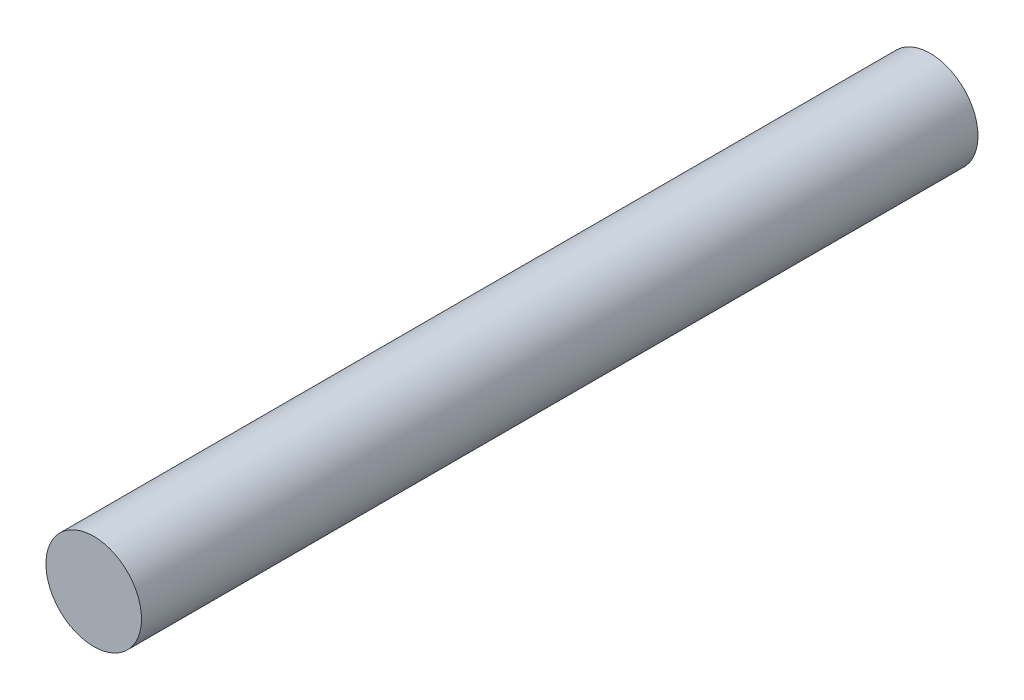
ISO-10303-21;
HEADER;
FILE_DESCRIPTION(('STEP AP214'),'2;1');
FILE_NAME('part.step','',(''),(''),'','','');
FILE_SCHEMA(('AUTOMOTIVE_DESIGN { 1 0 10303 214 1 1 1 1 }'));
ENDSEC;
DATA;
#1=APPLICATION_CONTEXT('core data for automotive mechanical design processes');
#2=APPLICATION_PROTOCOL_DEFINITION('international standard','automotive_design',2000,#1);
#3=PRODUCT_CONTEXT('',#1,'mechanical');
#4=PRODUCT('Part','Part','',(#3));
#5=PRODUCT_RELATED_PRODUCT_CATEGORY('part','',(#4));
#6=PRODUCT_DEFINITION_FORMATION('','',#4);
#7=PRODUCT_DEFINITION_CONTEXT('part definition',#1,'design');
#8=PRODUCT_DEFINITION('design','',#6,#7);
#9=PRODUCT_DEFINITION_SHAPE('','',#8);
#10=(LENGTH_UNIT() NAMED_UNIT(*) SI_UNIT(.MILLI.,.METRE.));
#11=(NAMED_UNIT(*) PLANE_ANGLE_UNIT() SI_UNIT($,.RADIAN.));
#12=(NAMED_UNIT(*) SI_UNIT($,.STERADIAN.) SOLID_ANGLE_UNIT());
#13=UNCERTAINTY_MEASURE_WITH_UNIT(LENGTH_MEASURE(1.E-05),#10,'distance_accuracy_value','');
#14=(GEOMETRIC_REPRESENTATION_CONTEXT(3) GLOBAL_UNCERTAINTY_ASSIGNED_CONTEXT((#13)) GLOBAL_UNIT_ASSIGNED_CONTEXT((#10,
#11,#12)) REPRESENTATION_CONTEXT('',''));
#15=CARTESIAN_POINT('',(0.,0.,0.));
#16=DIRECTION('',(0.,0.,1.));
#17=DIRECTION('',(1.,0.,0.));
#18=AXIS2_PLACEMENT_3D('',#15,#16,#17);
#19=CARTESIAN_POINT('',(0.,0.,70.));
#20=DIRECTION('',(0.,0.,-1.));
#21=DIRECTION('',(-1.,0.,0.));
#22=AXIS2_PLACEMENT_3D('',#19,#20,#21);
#23=CYLINDRICAL_SURFACE('',#22,4.);
#24=CARTESIAN_POINT('',(0.,0.,70.));
#25=DIRECTION('',(0.,0.,1.));
#26=DIRECTION('',(1.,0.,0.));
#27=AXIS2_PLACEMENT_3D('',#24,#25,#26);
#28=CIRCLE('',#27,4.);
#29=CARTESIAN_POINT('',(4.,0.,70.));
#30=VERTEX_POINT('',#29);
#31=EDGE_CURVE('E10',#30,#30,#28,.T.);
#32=ORIENTED_EDGE('',*,*,#31,.F.);
#33=EDGE_LOOP('',(#32));
#34=FACE_BOUND('',#33,.T.);
#35=CARTESIAN_POINT('',(0.,0.,0.));
#36=DIRECTION('',(0.,0.,1.));
#37=DIRECTION('',(1.,0.,0.));
#38=AXIS2_PLACEMENT_3D('',#35,#36,#37);
#39=CIRCLE('',#38,4.);
#40=CARTESIAN_POINT('',(4.,0.,0.));
#41=VERTEX_POINT('',#40);
#42=EDGE_CURVE('E34',#41,#41,#39,.T.);
#43=ORIENTED_EDGE('',*,*,#42,.T.);
#44=EDGE_LOOP('',(#43));
#45=FACE_BOUND('',#44,.T.);
#46=ADVANCED_FACE('F31',(#34,#45),#23,.T.);
#47=CARTESIAN_POINT('',(0.,0.,70.));
#48=DIRECTION('',(0.,0.,1.));
#49=DIRECTION('',(1.,0.,0.));
#50=AXIS2_PLACEMENT_3D('',#47,#48,#49);
#51=PLANE('',#50);
#52=ORIENTED_EDGE('',*,*,#31,.T.);
#53=EDGE_LOOP('',(#52));
#54=FACE_BOUND('',#53,.T.);
#55=ADVANCED_FACE('F46',(#54),#51,.T.);
#56=CARTESIAN_POINT('',(0.,0.,0.));
#57=DIRECTION('',(0.,0.,1.));
#58=DIRECTION('',(1.,0.,0.));
#59=AXIS2_PLACEMENT_3D('',#56,#57,#58);
#60=PLANE('',#59);
#61=ORIENTED_EDGE('',*,*,#42,.F.);
#62=EDGE_LOOP('',(#61));
#63=FACE_BOUND('',#62,.T.);
#64=ADVANCED_FACE('F44',(#63),#60,.F.);
#65=CLOSED_SHELL('',(#46,#55,#64));
#66=MANIFOLD_SOLID_BREP('B2',#65);
#67=ADVANCED_BREP_SHAPE_REPRESENTATION('',(#18,#66),#14);
#68=SHAPE_DEFINITION_REPRESENTATION(#9,#67);
ENDSEC;
END-ISO-10303-21;
